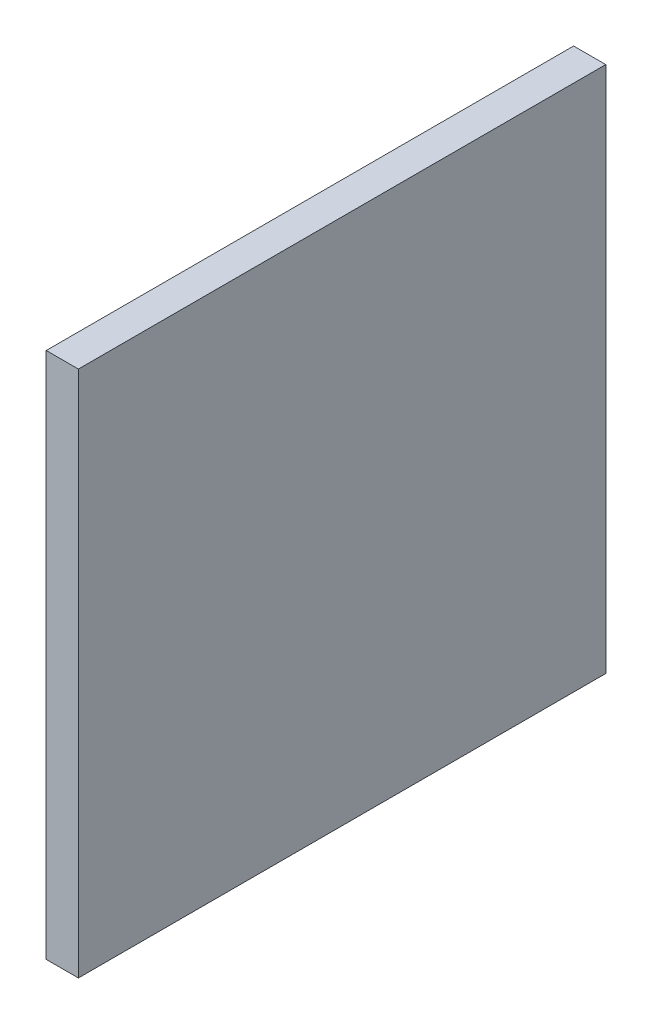
ISO-10303-21;
HEADER;
FILE_DESCRIPTION(('STEP AP214'),'2;1');
FILE_NAME('part.step','',(''),(''),'','','');
FILE_SCHEMA(('AUTOMOTIVE_DESIGN { 1 0 10303 214 1 1 1 1 }'));
ENDSEC;
DATA;
#1=APPLICATION_CONTEXT('core data for automotive mechanical design processes');
#2=APPLICATION_PROTOCOL_DEFINITION('international standard','automotive_design',2000,#1);
#3=PRODUCT_CONTEXT('',#1,'mechanical');
#4=PRODUCT('Part','Part','',(#3));
#5=PRODUCT_RELATED_PRODUCT_CATEGORY('part','',(#4));
#6=PRODUCT_DEFINITION_FORMATION('','',#4);
#7=PRODUCT_DEFINITION_CONTEXT('part definition',#1,'design');
#8=PRODUCT_DEFINITION('design','',#6,#7);
#9=PRODUCT_DEFINITION_SHAPE('','',#8);
#10=(LENGTH_UNIT() NAMED_UNIT(*) SI_UNIT(.MILLI.,.METRE.));
#11=(NAMED_UNIT(*) PLANE_ANGLE_UNIT() SI_UNIT($,.RADIAN.));
#12=(NAMED_UNIT(*) SI_UNIT($,.STERADIAN.) SOLID_ANGLE_UNIT());
#13=UNCERTAINTY_MEASURE_WITH_UNIT(LENGTH_MEASURE(1.E-05),#10,'distance_accuracy_value','');
#14=(GEOMETRIC_REPRESENTATION_CONTEXT(3) GLOBAL_UNCERTAINTY_ASSIGNED_CONTEXT((#13)) GLOBAL_UNIT_ASSIGNED_CONTEXT((#10,
#11,#12)) REPRESENTATION_CONTEXT('',''));
#15=CARTESIAN_POINT('',(0.,0.,0.));
#16=DIRECTION('',(0.,0.,1.));
#17=DIRECTION('',(1.,0.,0.));
#18=AXIS2_PLACEMENT_3D('',#15,#16,#17);
#19=CARTESIAN_POINT('',(0.,18.99,141.01));
#20=DIRECTION('',(1.,0.,0.));
#21=DIRECTION('',(0.,0.,-1.));
#22=AXIS2_PLACEMENT_3D('',#19,#20,#21);
#23=PLANE('',#22);
#24=DIRECTION('',(0.,0.,-1.));
#25=VECTOR('',#24,1.);
#26=CARTESIAN_POINT('',(0.,101.,100.));
#27=LINE('',#26,#25);
#28=CARTESIAN_POINT('',(0.,101.,141.));
#29=VERTEX_POINT('',#28);
#30=CARTESIAN_POINT('',(0.,101.,59.));
#31=VERTEX_POINT('',#30);
#32=EDGE_CURVE('E74',#29,#31,#27,.T.);
#33=ORIENTED_EDGE('',*,*,#32,.F.);
#34=DIRECTION('',(0.,1.,0.));
#35=VECTOR('',#34,1.);
#36=CARTESIAN_POINT('',(0.,60.,141.));
#37=LINE('',#36,#35);
#38=CARTESIAN_POINT('',(0.,19.,141.));
#39=VERTEX_POINT('',#38);
#40=EDGE_CURVE('E76',#39,#29,#37,.T.);
#41=ORIENTED_EDGE('',*,*,#40,.F.);
#42=DIRECTION('',(0.,0.,1.));
#43=VECTOR('',#42,1.);
#44=CARTESIAN_POINT('',(0.,19.,100.));
#45=LINE('',#44,#43);
#46=CARTESIAN_POINT('',(0.,19.,59.));
#47=VERTEX_POINT('',#46);
#48=EDGE_CURVE('E21',#47,#39,#45,.T.);
#49=ORIENTED_EDGE('',*,*,#48,.F.);
#50=DIRECTION('',(0.,-1.,0.));
#51=VECTOR('',#50,1.);
#52=CARTESIAN_POINT('',(0.,60.,59.));
#53=LINE('',#52,#51);
#54=EDGE_CURVE('E98',#31,#47,#53,.T.);
#55=ORIENTED_EDGE('',*,*,#54,.F.);
#56=EDGE_LOOP('',(#33,#41,#49,#55));
#57=FACE_BOUND('',#56,.T.);
#58=ADVANCED_FACE('F17',(#57),#23,.T.);
#59=CARTESIAN_POINT('',(0.01,19.,58.99));
#60=DIRECTION('',(0.,-1.,0.));
#61=DIRECTION('',(0.,0.,1.));
#62=AXIS2_PLACEMENT_3D('',#59,#60,#61);
#63=PLANE('',#62);
#64=DIRECTION('',(0.,0.,1.));
#65=VECTOR('',#64,1.);
#66=CARTESIAN_POINT('',(-5.,19.,100.));
#67=LINE('',#66,#65);
#68=CARTESIAN_POINT('',(-5.,19.,59.));
#69=VERTEX_POINT('',#68);
#70=CARTESIAN_POINT('',(-5.,19.,141.));
#71=VERTEX_POINT('',#70);
#72=EDGE_CURVE('E109',#69,#71,#67,.T.);
#73=ORIENTED_EDGE('',*,*,#72,.F.);
#74=DIRECTION('',(-1.,0.,0.));
#75=VECTOR('',#74,1.);
#76=CARTESIAN_POINT('',(-2.5,19.,59.));
#77=LINE('',#76,#75);
#78=EDGE_CURVE('E87',#47,#69,#77,.T.);
#79=ORIENTED_EDGE('',*,*,#78,.F.);
#80=ORIENTED_EDGE('',*,*,#48,.T.);
#81=DIRECTION('',(1.,0.,0.));
#82=VECTOR('',#81,1.);
#83=CARTESIAN_POINT('',(-2.5,19.,141.));
#84=LINE('',#83,#82);
#85=EDGE_CURVE('E82',#71,#39,#84,.T.);
#86=ORIENTED_EDGE('',*,*,#85,.F.);
#87=EDGE_LOOP('',(#73,#79,#80,#86));
#88=FACE_BOUND('',#87,.T.);
#89=ADVANCED_FACE('F84',(#88),#63,.T.);
#90=CARTESIAN_POINT('',(0.01,18.99,141.));
#91=DIRECTION('',(0.,0.,1.));
#92=DIRECTION('',(0.,1.,0.));
#93=AXIS2_PLACEMENT_3D('',#90,#91,#92);
#94=PLANE('',#93);
#95=DIRECTION('',(0.,1.,0.));
#96=VECTOR('',#95,1.);
#97=CARTESIAN_POINT('',(-5.,60.,141.));
#98=LINE('',#97,#96);
#99=CARTESIAN_POINT('',(-5.,101.,141.));
#100=VERTEX_POINT('',#99);
#101=EDGE_CURVE('E91',#71,#100,#98,.T.);
#102=ORIENTED_EDGE('',*,*,#101,.F.);
#103=ORIENTED_EDGE('',*,*,#85,.T.);
#104=ORIENTED_EDGE('',*,*,#40,.T.);
#105=DIRECTION('',(1.,0.,0.));
#106=VECTOR('',#105,1.);
#107=CARTESIAN_POINT('',(-2.5,101.,141.));
#108=LINE('',#107,#106);
#109=EDGE_CURVE('E94',#100,#29,#108,.T.);
#110=ORIENTED_EDGE('',*,*,#109,.F.);
#111=EDGE_LOOP('',(#102,#103,#104,#110));
#112=FACE_BOUND('',#111,.T.);
#113=ADVANCED_FACE('F89',(#112),#94,.T.);
#114=CARTESIAN_POINT('',(0.01,101.,141.01));
#115=DIRECTION('',(0.,1.,0.));
#116=DIRECTION('',(0.,0.,-1.));
#117=AXIS2_PLACEMENT_3D('',#114,#115,#116);
#118=PLANE('',#117);
#119=DIRECTION('',(0.,0.,-1.));
#120=VECTOR('',#119,1.);
#121=CARTESIAN_POINT('',(-5.,101.,100.));
#122=LINE('',#121,#120);
#123=CARTESIAN_POINT('',(-5.,101.,59.));
#124=VERTEX_POINT('',#123);
#125=EDGE_CURVE('E112',#100,#124,#122,.T.);
#126=ORIENTED_EDGE('',*,*,#125,.F.);
#127=ORIENTED_EDGE('',*,*,#109,.T.);
#128=ORIENTED_EDGE('',*,*,#32,.T.);
#129=DIRECTION('',(1.,0.,0.));
#130=VECTOR('',#129,1.);
#131=CARTESIAN_POINT('',(-2.5,101.,59.));
#132=LINE('',#131,#130);
#133=EDGE_CURVE('E101',#124,#31,#132,.T.);
#134=ORIENTED_EDGE('',*,*,#133,.F.);
#135=EDGE_LOOP('',(#126,#127,#128,#134));
#136=FACE_BOUND('',#135,.T.);
#137=ADVANCED_FACE('F152',(#136),#118,.T.);
#138=CARTESIAN_POINT('',(0.01,101.01,59.));
#139=DIRECTION('',(0.,0.,-1.));
#140=DIRECTION('',(0.,-1.,0.));
#141=AXIS2_PLACEMENT_3D('',#138,#139,#140);
#142=PLANE('',#141);
#143=DIRECTION('',(0.,-1.,0.));
#144=VECTOR('',#143,1.);
#145=CARTESIAN_POINT('',(-5.,60.,59.));
#146=LINE('',#145,#144);
#147=EDGE_CURVE('E115',#124,#69,#146,.T.);
#148=ORIENTED_EDGE('',*,*,#147,.F.);
#149=ORIENTED_EDGE('',*,*,#133,.T.);
#150=ORIENTED_EDGE('',*,*,#54,.T.);
#151=ORIENTED_EDGE('',*,*,#78,.T.);
#152=EDGE_LOOP('',(#148,#149,#150,#151));
#153=FACE_BOUND('',#152,.T.);
#154=ADVANCED_FACE('F144',(#153),#142,.T.);
#155=CARTESIAN_POINT('',(-4.99,85.01,75.));
#156=DIRECTION('',(0.,0.,-1.));
#157=DIRECTION('',(0.,-1.,0.));
#158=AXIS2_PLACEMENT_3D('',#155,#156,#157);
#159=PLANE('',#158);
#160=DIRECTION('',(0.,1.,0.));
#161=VECTOR('',#160,1.);
#162=CARTESIAN_POINT('',(-5.,60.,75.));
#163=LINE('',#162,#161);
#164=CARTESIAN_POINT('',(-5.,35.,75.));
#165=VERTEX_POINT('',#164);
#166=CARTESIAN_POINT('',(-5.,85.,75.));
#167=VERTEX_POINT('',#166);
#168=EDGE_CURVE('E118',#165,#167,#163,.T.);
#169=ORIENTED_EDGE('',*,*,#168,.F.);
#170=DIRECTION('',(1.,0.,0.));
#171=VECTOR('',#170,1.);
#172=CARTESIAN_POINT('',(-7.5,35.,75.));
#173=LINE('',#172,#171);
#174=CARTESIAN_POINT('',(-10.,35.,75.));
#175=VERTEX_POINT('',#174);
#176=EDGE_CURVE('E104',#175,#165,#173,.T.);
#177=ORIENTED_EDGE('',*,*,#176,.F.);
#178=DIRECTION('',(-0.0995037190209987,-0.995037190209989,0.));
#179=VECTOR('',#178,1.);
#180=CARTESIAN_POINT('',(-7.49999999999999,60.,75.));
#181=LINE('',#180,#179);
#182=EDGE_CURVE('E125',#167,#175,#181,.T.);
#183=ORIENTED_EDGE('',*,*,#182,.F.);
#184=EDGE_LOOP('',(#169,#177,#183));
#185=FACE_BOUND('',#184,.T.);
#186=ADVANCED_FACE('F142',(#185),#159,.T.);
#187=CARTESIAN_POINT('',(-4.99,35.,74.99));
#188=DIRECTION('',(0.,-1.,0.));
#189=DIRECTION('',(0.,0.,1.));
#190=AXIS2_PLACEMENT_3D('',#187,#188,#189);
#191=PLANE('',#190);
#192=DIRECTION('',(0.,0.,1.));
#193=VECTOR('',#192,1.);
#194=CARTESIAN_POINT('',(-9.99999999999999,35.,100.));
#195=LINE('',#194,#193);
#196=CARTESIAN_POINT('',(-10.,35.,125.));
#197=VERTEX_POINT('',#196);
#198=EDGE_CURVE('E128',#175,#197,#195,.T.);
#199=ORIENTED_EDGE('',*,*,#198,.F.);
#200=ORIENTED_EDGE('',*,*,#176,.T.);
#201=DIRECTION('',(0.,0.,-1.));
#202=VECTOR('',#201,1.);
#203=CARTESIAN_POINT('',(-5.,35.,100.));
#204=LINE('',#203,#202);
#205=CARTESIAN_POINT('',(-5.,35.,125.));
#206=VERTEX_POINT('',#205);
#207=EDGE_CURVE('E122',#206,#165,#204,.T.);
#208=ORIENTED_EDGE('',*,*,#207,.F.);
#209=DIRECTION('',(1.,0.,0.));
#210=VECTOR('',#209,1.);
#211=CARTESIAN_POINT('',(-7.5,35.,125.));
#212=LINE('',#211,#210);
#213=EDGE_CURVE('E107',#197,#206,#212,.T.);
#214=ORIENTED_EDGE('',*,*,#213,.F.);
#215=EDGE_LOOP('',(#199,#200,#208,#214));
#216=FACE_BOUND('',#215,.T.);
#217=ADVANCED_FACE('F137',(#216),#191,.T.);
#218=CARTESIAN_POINT('',(-4.99,34.99,125.));
#219=DIRECTION('',(0.,0.,1.));
#220=DIRECTION('',(0.,1.,0.));
#221=AXIS2_PLACEMENT_3D('',#218,#219,#220);
#222=PLANE('',#221);
#223=ORIENTED_EDGE('',*,*,#213,.T.);
#224=DIRECTION('',(0.,-1.,0.));
#225=VECTOR('',#224,1.);
#226=CARTESIAN_POINT('',(-5.,60.,125.));
#227=LINE('',#226,#225);
#228=CARTESIAN_POINT('',(-5.,85.,125.));
#229=VERTEX_POINT('',#228);
#230=EDGE_CURVE('E36',#229,#206,#227,.T.);
#231=ORIENTED_EDGE('',*,*,#230,.F.);
#232=DIRECTION('',(0.0995037190209987,0.995037190209989,0.));
#233=VECTOR('',#232,1.);
#234=CARTESIAN_POINT('',(-7.49999999999999,60.,125.));
#235=LINE('',#234,#233);
#236=EDGE_CURVE('E27',#197,#229,#235,.T.);
#237=ORIENTED_EDGE('',*,*,#236,.F.);
#238=EDGE_LOOP('',(#223,#231,#237));
#239=FACE_BOUND('',#238,.T.);
#240=ADVANCED_FACE('F134',(#239),#222,.T.);
#241=CARTESIAN_POINT('',(-5.,18.99,58.99));
#242=DIRECTION('',(-1.,0.,0.));
#243=DIRECTION('',(0.,0.,1.));
#244=AXIS2_PLACEMENT_3D('',#241,#242,#243);
#245=PLANE('',#244);
#246=ORIENTED_EDGE('',*,*,#230,.T.);
#247=ORIENTED_EDGE('',*,*,#207,.T.);
#248=ORIENTED_EDGE('',*,*,#168,.T.);
#249=DIRECTION('',(0.,0.,-1.));
#250=VECTOR('',#249,1.);
#251=CARTESIAN_POINT('',(-5.,85.,100.));
#252=LINE('',#251,#250);
#253=EDGE_CURVE('E11',#229,#167,#252,.T.);
#254=ORIENTED_EDGE('',*,*,#253,.F.);
#255=EDGE_LOOP('',(#246,#247,#248,#254));
#256=FACE_BOUND('',#255,.T.);
#257=ORIENTED_EDGE('',*,*,#125,.T.);
#258=ORIENTED_EDGE('',*,*,#147,.T.);
#259=ORIENTED_EDGE('',*,*,#72,.T.);
#260=ORIENTED_EDGE('',*,*,#101,.T.);
#261=EDGE_LOOP('',(#257,#258,#259,#260));
#262=FACE_BOUND('',#261,.T.);
#263=ADVANCED_FACE('F139',(#256,#262),#245,.T.);
#264=CARTESIAN_POINT('',(-10.0009950371902,34.9900496280979,125.01));
#265=DIRECTION('',(-0.995037190209989,0.0995037190209987,0.));
#266=DIRECTION('',(0.0995037190209987,0.995037190209989,0.));
#267=AXIS2_PLACEMENT_3D('',#264,#265,#266);
#268=PLANE('',#267);
#269=ORIENTED_EDGE('',*,*,#236,.T.);
#270=ORIENTED_EDGE('',*,*,#253,.T.);
#271=ORIENTED_EDGE('',*,*,#182,.T.);
#272=ORIENTED_EDGE('',*,*,#198,.T.);
#273=EDGE_LOOP('',(#269,#270,#271,#272));
#274=FACE_BOUND('',#273,.T.);
#275=ADVANCED_FACE('F19',(#274),#268,.T.);
#276=CLOSED_SHELL('',(#58,#89,#113,#137,#154,#186,#217,#240,#263,#275));
#277=MANIFOLD_SOLID_BREP('B1',#276);
#278=ADVANCED_BREP_SHAPE_REPRESENTATION('',(#18,#277),#14);
#279=SHAPE_DEFINITION_REPRESENTATION(#9,#278);
ENDSEC;
END-ISO-10303-21;
